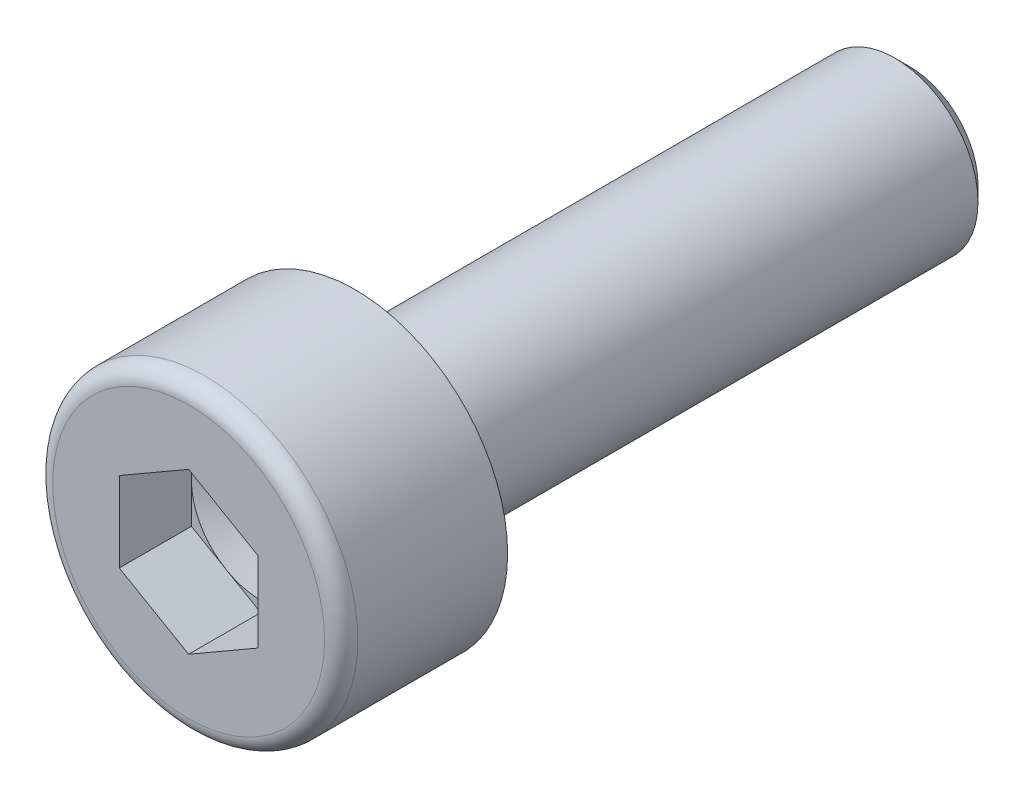
ISO-10303-21;
HEADER;
FILE_DESCRIPTION(('STEP AP214'),'2;1');
FILE_NAME('part.step','',(''),(''),'','','');
FILE_SCHEMA(('AUTOMOTIVE_DESIGN { 1 0 10303 214 1 1 1 1 }'));
ENDSEC;
DATA;
#1=APPLICATION_CONTEXT('core data for automotive mechanical design processes');
#2=APPLICATION_PROTOCOL_DEFINITION('international standard','automotive_design',2000,#1);
#3=PRODUCT_CONTEXT('',#1,'mechanical');
#4=PRODUCT('Part','Part','',(#3));
#5=PRODUCT_RELATED_PRODUCT_CATEGORY('part','',(#4));
#6=PRODUCT_DEFINITION_FORMATION('','',#4);
#7=PRODUCT_DEFINITION_CONTEXT('part definition',#1,'design');
#8=PRODUCT_DEFINITION('design','',#6,#7);
#9=PRODUCT_DEFINITION_SHAPE('','',#8);
#10=(LENGTH_UNIT() NAMED_UNIT(*) SI_UNIT(.MILLI.,.METRE.));
#11=(NAMED_UNIT(*) PLANE_ANGLE_UNIT() SI_UNIT($,.RADIAN.));
#12=(NAMED_UNIT(*) SI_UNIT($,.STERADIAN.) SOLID_ANGLE_UNIT());
#13=UNCERTAINTY_MEASURE_WITH_UNIT(LENGTH_MEASURE(1.E-05),#10,'distance_accuracy_value','');
#14=(GEOMETRIC_REPRESENTATION_CONTEXT(3) GLOBAL_UNCERTAINTY_ASSIGNED_CONTEXT((#13)) GLOBAL_UNIT_ASSIGNED_CONTEXT((#10,
#11,#12)) REPRESENTATION_CONTEXT('',''));
#15=CARTESIAN_POINT('',(0.,0.,0.));
#16=DIRECTION('',(0.,0.,1.));
#17=DIRECTION('',(1.,0.,0.));
#18=AXIS2_PLACEMENT_3D('',#15,#16,#17);
#19=CARTESIAN_POINT('',(0.,0.,-1.3));
#20=DIRECTION('',(0.,0.,1.));
#21=DIRECTION('',(1.,0.,0.));
#22=AXIS2_PLACEMENT_3D('',#19,#20,#21);
#23=PLANE('',#22);
#24=DIRECTION('',(0.,1.,0.));
#25=VECTOR('',#24,1.);
#26=CARTESIAN_POINT('',(-1.25,0.,-1.3));
#27=LINE('',#26,#25);
#28=CARTESIAN_POINT('',(-1.25,0.,-1.3));
#29=VERTEX_POINT('',#28);
#30=CARTESIAN_POINT('',(-1.25,0.721687836487032,-1.3));
#31=VERTEX_POINT('',#30);
#32=EDGE_CURVE('E289',#29,#31,#27,.T.);
#33=ORIENTED_EDGE('',*,*,#32,.F.);
#34=CARTESIAN_POINT('',(0.,0.,-1.3));
#35=DIRECTION('',(0.,0.,-1.));
#36=DIRECTION('',(-1.,0.,0.));
#37=AXIS2_PLACEMENT_3D('',#34,#35,#36);
#38=CIRCLE('',#37,1.25);
#39=CARTESIAN_POINT('',(-0.625,1.08253175473055,-1.3));
#40=VERTEX_POINT('',#39);
#41=EDGE_CURVE('E38',#29,#40,#38,.T.);
#42=ORIENTED_EDGE('',*,*,#41,.T.);
#43=DIRECTION('',(0.866025403784439,0.5,0.));
#44=VECTOR('',#43,1.);
#45=CARTESIAN_POINT('',(-0.617562637900043,1.08682571774102,-1.3));
#46=LINE('',#45,#44);
#47=EDGE_CURVE('E290',#31,#40,#46,.T.);
#48=ORIENTED_EDGE('',*,*,#47,.F.);
#49=EDGE_LOOP('',(#33,#42,#48));
#50=FACE_BOUND('',#49,.T.);
#51=ADVANCED_FACE('F17',(#50),#23,.T.);
#52=CARTESIAN_POINT('',(0.,1.44337567297406,-1.3));
#53=VERTEX_POINT('',#52);
#54=EDGE_CURVE('E294',#40,#53,#46,.T.);
#55=ORIENTED_EDGE('',*,*,#54,.F.);
#56=CARTESIAN_POINT('',(0.625,1.08253175473055,-1.3));
#57=VERTEX_POINT('',#56);
#58=EDGE_CURVE('E305',#40,#57,#38,.T.);
#59=ORIENTED_EDGE('',*,*,#58,.T.);
#60=DIRECTION('',(0.866025403784439,-0.5,0.));
#61=VECTOR('',#60,1.);
#62=CARTESIAN_POINT('',(0.625,1.08253175473055,-1.3));
#63=LINE('',#62,#61);
#64=EDGE_CURVE('E295',#53,#57,#63,.T.);
#65=ORIENTED_EDGE('',*,*,#64,.F.);
#66=EDGE_LOOP('',(#55,#59,#65));
#67=FACE_BOUND('',#66,.T.);
#68=ADVANCED_FACE('F134',(#67),#23,.T.);
#69=CARTESIAN_POINT('',(1.25,0.721687836487032,-1.3));
#70=VERTEX_POINT('',#69);
#71=EDGE_CURVE('E299',#57,#70,#63,.T.);
#72=ORIENTED_EDGE('',*,*,#71,.F.);
#73=CARTESIAN_POINT('',(1.25,0.,-1.3));
#74=VERTEX_POINT('',#73);
#75=EDGE_CURVE('E313',#57,#74,#38,.T.);
#76=ORIENTED_EDGE('',*,*,#75,.T.);
#77=DIRECTION('',(0.,-1.,0.));
#78=VECTOR('',#77,1.);
#79=CARTESIAN_POINT('',(1.25,0.,-1.3));
#80=LINE('',#79,#78);
#81=EDGE_CURVE('E300',#70,#74,#80,.T.);
#82=ORIENTED_EDGE('',*,*,#81,.F.);
#83=EDGE_LOOP('',(#72,#76,#82));
#84=FACE_BOUND('',#83,.T.);
#85=ADVANCED_FACE('F139',(#84),#23,.T.);
#86=CARTESIAN_POINT('',(1.25,-0.721687836487032,-1.3));
#87=VERTEX_POINT('',#86);
#88=EDGE_CURVE('E257',#74,#87,#80,.T.);
#89=ORIENTED_EDGE('',*,*,#88,.F.);
#90=CARTESIAN_POINT('',(0.625,-1.08253175473055,-1.3));
#91=VERTEX_POINT('',#90);
#92=EDGE_CURVE('E321',#74,#91,#38,.T.);
#93=ORIENTED_EDGE('',*,*,#92,.T.);
#94=DIRECTION('',(-0.866025403784439,-0.5,0.));
#95=VECTOR('',#94,1.);
#96=CARTESIAN_POINT('',(0.596250214161918,-1.09913045132331,-1.3));
#97=LINE('',#96,#95);
#98=EDGE_CURVE('E252',#87,#91,#97,.T.);
#99=ORIENTED_EDGE('',*,*,#98,.F.);
#100=EDGE_LOOP('',(#89,#93,#99));
#101=FACE_BOUND('',#100,.T.);
#102=ADVANCED_FACE('F338',(#101),#23,.T.);
#103=CARTESIAN_POINT('',(0.,-1.44337567297406,-1.3));
#104=VERTEX_POINT('',#103);
#105=EDGE_CURVE('E279',#91,#104,#97,.T.);
#106=ORIENTED_EDGE('',*,*,#105,.F.);
#107=CARTESIAN_POINT('',(-0.625,-1.08253175473055,-1.3));
#108=VERTEX_POINT('',#107);
#109=EDGE_CURVE('E314',#91,#108,#38,.T.);
#110=ORIENTED_EDGE('',*,*,#109,.T.);
#111=DIRECTION('',(-0.866025403784439,0.5,0.));
#112=VECTOR('',#111,1.);
#113=CARTESIAN_POINT('',(-0.625,-1.08253175473055,-1.3));
#114=LINE('',#113,#112);
#115=EDGE_CURVE('E280',#104,#108,#114,.T.);
#116=ORIENTED_EDGE('',*,*,#115,.F.);
#117=EDGE_LOOP('',(#106,#110,#116));
#118=FACE_BOUND('',#117,.T.);
#119=ADVANCED_FACE('F132',(#118),#23,.T.);
#120=CARTESIAN_POINT('',(-1.10172582585694,0.,0.));
#121=DIRECTION('',(0.,0.,-1.));
#122=DIRECTION('',(-1.,0.,0.));
#123=AXIS2_PLACEMENT_3D('',#120,#121,#122);
#124=PLANE('',#123);
#125=CARTESIAN_POINT('',(0.,0.,0.));
#126=DIRECTION('',(0.,0.,1.));
#127=DIRECTION('',(1.,0.,0.));
#128=AXIS2_PLACEMENT_3D('',#125,#126,#127);
#129=CIRCLE('',#128,2.45);
#130=CARTESIAN_POINT('',(2.45,0.,0.));
#131=VERTEX_POINT('',#130);
#132=EDGE_CURVE('E222',#131,#131,#129,.T.);
#133=ORIENTED_EDGE('',*,*,#132,.T.);
#134=EDGE_LOOP('',(#133));
#135=FACE_BOUND('',#134,.T.);
#136=DIRECTION('',(0.,-1.,0.));
#137=VECTOR('',#136,1.);
#138=CARTESIAN_POINT('',(1.25,0.,0.));
#139=LINE('',#138,#137);
#140=CARTESIAN_POINT('',(1.25,0.721687836487032,0.));
#141=VERTEX_POINT('',#140);
#142=CARTESIAN_POINT('',(1.25,-0.721687836487032,0.));
#143=VERTEX_POINT('',#142);
#144=EDGE_CURVE('E272',#141,#143,#139,.T.);
#145=ORIENTED_EDGE('',*,*,#144,.T.);
#146=DIRECTION('',(-0.866025403784439,-0.5,0.));
#147=VECTOR('',#146,1.);
#148=CARTESIAN_POINT('',(0.596250214161918,-1.09913045132331,0.));
#149=LINE('',#148,#147);
#150=CARTESIAN_POINT('',(0.,-1.44337567297406,0.));
#151=VERTEX_POINT('',#150);
#152=EDGE_CURVE('E253',#143,#151,#149,.T.);
#153=ORIENTED_EDGE('',*,*,#152,.T.);
#154=DIRECTION('',(-0.866025403784439,0.5,0.));
#155=VECTOR('',#154,1.);
#156=CARTESIAN_POINT('',(-0.625,-1.08253175473055,0.));
#157=LINE('',#156,#155);
#158=CARTESIAN_POINT('',(-1.25,-0.721687836487032,0.));
#159=VERTEX_POINT('',#158);
#160=EDGE_CURVE('E50',#151,#159,#157,.T.);
#161=ORIENTED_EDGE('',*,*,#160,.T.);
#162=DIRECTION('',(0.,1.,0.));
#163=VECTOR('',#162,1.);
#164=CARTESIAN_POINT('',(-1.25,0.,0.));
#165=LINE('',#164,#163);
#166=CARTESIAN_POINT('',(-1.25,0.721687836487032,0.));
#167=VERTEX_POINT('',#166);
#168=EDGE_CURVE('E260',#159,#167,#165,.T.);
#169=ORIENTED_EDGE('',*,*,#168,.T.);
#170=DIRECTION('',(0.866025403784439,0.5,0.));
#171=VECTOR('',#170,1.);
#172=CARTESIAN_POINT('',(-0.617562637900043,1.08682571774102,0.));
#173=LINE('',#172,#171);
#174=CARTESIAN_POINT('',(0.,1.44337567297406,0.));
#175=VERTEX_POINT('',#174);
#176=EDGE_CURVE('E264',#167,#175,#173,.T.);
#177=ORIENTED_EDGE('',*,*,#176,.T.);
#178=DIRECTION('',(0.866025403784439,-0.5,0.));
#179=VECTOR('',#178,1.);
#180=CARTESIAN_POINT('',(0.625,1.08253175473055,0.));
#181=LINE('',#180,#179);
#182=EDGE_CURVE('E268',#175,#141,#181,.T.);
#183=ORIENTED_EDGE('',*,*,#182,.T.);
#184=EDGE_LOOP('',(#145,#153,#161,#169,#177,#183));
#185=FACE_BOUND('',#184,.T.);
#186=ADVANCED_FACE('F184',(#135,#185),#124,.F.);
#187=CARTESIAN_POINT('',(0.,0.,-0.3));
#188=DIRECTION('',(0.,0.,1.));
#189=DIRECTION('',(1.,0.,0.));
#190=AXIS2_PLACEMENT_3D('',#187,#188,#189);
#191=TOROIDAL_SURFACE('',#190,2.45,0.3);
#192=CARTESIAN_POINT('',(0.,0.,-0.3));
#193=DIRECTION('',(0.,0.,1.));
#194=DIRECTION('',(1.,0.,0.));
#195=AXIS2_PLACEMENT_3D('',#192,#193,#194);
#196=CIRCLE('',#195,2.75);
#197=CARTESIAN_POINT('',(2.75,0.,-0.3));
#198=VERTEX_POINT('',#197);
#199=EDGE_CURVE('E226',#198,#198,#196,.T.);
#200=ORIENTED_EDGE('',*,*,#199,.T.);
#201=EDGE_LOOP('',(#200));
#202=FACE_BOUND('',#201,.T.);
#203=ORIENTED_EDGE('',*,*,#132,.F.);
#204=EDGE_LOOP('',(#203));
#205=FACE_BOUND('',#204,.T.);
#206=ADVANCED_FACE('F180',(#202,#205),#191,.T.);
#207=CARTESIAN_POINT('',(0.,0.,-6.5));
#208=DIRECTION('',(0.,0.,1.));
#209=DIRECTION('',(1.,0.,0.));
#210=AXIS2_PLACEMENT_3D('',#207,#208,#209);
#211=CYLINDRICAL_SURFACE('',#210,2.75);
#212=ORIENTED_EDGE('',*,*,#199,.F.);
#213=EDGE_LOOP('',(#212));
#214=FACE_BOUND('',#213,.T.);
#215=CARTESIAN_POINT('',(0.,0.,-3.));
#216=DIRECTION('',(0.,0.,1.));
#217=DIRECTION('',(1.,0.,0.));
#218=AXIS2_PLACEMENT_3D('',#215,#216,#217);
#219=CIRCLE('',#218,2.75);
#220=CARTESIAN_POINT('',(2.75,0.,-3.));
#221=VERTEX_POINT('',#220);
#222=EDGE_CURVE('E230',#221,#221,#219,.T.);
#223=ORIENTED_EDGE('',*,*,#222,.T.);
#224=EDGE_LOOP('',(#223));
#225=FACE_BOUND('',#224,.T.);
#226=ADVANCED_FACE('F176',(#214,#225),#211,.T.);
#227=CARTESIAN_POINT('',(-1.61056634651914,0.,-3.));
#228=DIRECTION('',(0.,0.,1.));
#229=DIRECTION('',(1.,0.,0.));
#230=AXIS2_PLACEMENT_3D('',#227,#228,#229);
#231=PLANE('',#230);
#232=CARTESIAN_POINT('',(0.,0.,-3.));
#233=DIRECTION('',(0.,0.,1.));
#234=DIRECTION('',(1.,0.,0.));
#235=AXIS2_PLACEMENT_3D('',#232,#233,#234);
#236=CIRCLE('',#235,1.85719460543127);
#237=CARTESIAN_POINT('',(1.85719460543127,0.,-3.));
#238=VERTEX_POINT('',#237);
#239=EDGE_CURVE('E204',#238,#238,#236,.T.);
#240=ORIENTED_EDGE('',*,*,#239,.T.);
#241=EDGE_LOOP('',(#240));
#242=FACE_BOUND('',#241,.T.);
#243=ORIENTED_EDGE('',*,*,#222,.F.);
#244=EDGE_LOOP('',(#243));
#245=FACE_BOUND('',#244,.T.);
#246=ADVANCED_FACE('F172',(#242,#245),#231,.F.);
#247=CARTESIAN_POINT('',(0.,0.,-6.5));
#248=DIRECTION('',(0.,0.,1.));
#249=DIRECTION('',(1.,0.,0.));
#250=AXIS2_PLACEMENT_3D('',#247,#248,#249);
#251=CYLINDRICAL_SURFACE('',#250,1.5);
#252=CARTESIAN_POINT('',(0.,0.,-12.7293670625));
#253=DIRECTION('',(0.,0.,1.));
#254=DIRECTION('',(1.,0.,0.));
#255=AXIS2_PLACEMENT_3D('',#252,#253,#254);
#256=CIRCLE('',#255,1.5);
#257=CARTESIAN_POINT('',(1.5,0.,-12.7293670625));
#258=VERTEX_POINT('',#257);
#259=EDGE_CURVE('E26',#258,#258,#256,.T.);
#260=ORIENTED_EDGE('',*,*,#259,.T.);
#261=EDGE_LOOP('',(#260));
#262=FACE_BOUND('',#261,.T.);
#263=CARTESIAN_POINT('',(0.,0.,-3.53723082923316));
#264=DIRECTION('',(0.,0.,-1.));
#265=DIRECTION('',(-1.,0.,0.));
#266=AXIS2_PLACEMENT_3D('',#263,#264,#265);
#267=CIRCLE('',#266,1.5);
#268=CARTESIAN_POINT('',(-1.5,0.,-3.53723082923316));
#269=VERTEX_POINT('',#268);
#270=EDGE_CURVE('E218',#269,#269,#267,.T.);
#271=ORIENTED_EDGE('',*,*,#270,.T.);
#272=EDGE_LOOP('',(#271));
#273=FACE_BOUND('',#272,.T.);
#274=ADVANCED_FACE('F168',(#262,#273),#251,.T.);
#275=CARTESIAN_POINT('',(-0.508840520662193,0.,-13.));
#276=DIRECTION('',(0.,0.,1.));
#277=DIRECTION('',(1.,0.,0.));
#278=AXIS2_PLACEMENT_3D('',#275,#276,#277);
#279=PLANE('',#278);
#280=CARTESIAN_POINT('',(0.,0.,-13.));
#281=DIRECTION('',(0.,0.,1.));
#282=DIRECTION('',(1.,0.,0.));
#283=AXIS2_PLACEMENT_3D('',#280,#281,#282);
#284=CIRCLE('',#283,1.2293670625);
#285=CARTESIAN_POINT('',(1.2293670625,0.,-13.));
#286=VERTEX_POINT('',#285);
#287=EDGE_CURVE('E11',#286,#286,#284,.F.);
#288=ORIENTED_EDGE('',*,*,#287,.T.);
#289=EDGE_LOOP('',(#288));
#290=FACE_BOUND('',#289,.T.);
#291=ADVANCED_FACE('F164',(#290),#279,.F.);
#292=CARTESIAN_POINT('',(1.25,0.,-1.3));
#293=DIRECTION('',(-1.,0.,0.));
#294=DIRECTION('',(0.,-1.,0.));
#295=AXIS2_PLACEMENT_3D('',#292,#293,#294);
#296=PLANE('',#295);
#297=ORIENTED_EDGE('',*,*,#144,.F.);
#298=DIRECTION('',(0.,0.,1.));
#299=VECTOR('',#298,1.);
#300=CARTESIAN_POINT('',(1.25,0.721687836487032,-1.3));
#301=LINE('',#300,#299);
#302=EDGE_CURVE('E234',#70,#141,#301,.T.);
#303=ORIENTED_EDGE('',*,*,#302,.F.);
#304=ORIENTED_EDGE('',*,*,#81,.T.);
#305=ORIENTED_EDGE('',*,*,#88,.T.);
#306=DIRECTION('',(0.,0.,1.));
#307=VECTOR('',#306,1.);
#308=CARTESIAN_POINT('',(1.25,-0.721687836487032,-1.3));
#309=LINE('',#308,#307);
#310=EDGE_CURVE('E249',#87,#143,#309,.T.);
#311=ORIENTED_EDGE('',*,*,#310,.T.);
#312=EDGE_LOOP('',(#297,#303,#304,#305,#311));
#313=FACE_BOUND('',#312,.T.);
#314=ADVANCED_FACE('F160',(#313),#296,.T.);
#315=CARTESIAN_POINT('',(0.625,1.08253175473055,-1.3));
#316=DIRECTION('',(-0.5,-0.866025403784439,0.));
#317=DIRECTION('',(0.866025403784439,-0.5,0.));
#318=AXIS2_PLACEMENT_3D('',#315,#316,#317);
#319=PLANE('',#318);
#320=ORIENTED_EDGE('',*,*,#182,.F.);
#321=DIRECTION('',(0.,0.,1.));
#322=VECTOR('',#321,1.);
#323=CARTESIAN_POINT('',(0.,1.44337567297406,-1.3));
#324=LINE('',#323,#322);
#325=EDGE_CURVE('E237',#53,#175,#324,.T.);
#326=ORIENTED_EDGE('',*,*,#325,.F.);
#327=ORIENTED_EDGE('',*,*,#64,.T.);
#328=ORIENTED_EDGE('',*,*,#71,.T.);
#329=ORIENTED_EDGE('',*,*,#302,.T.);
#330=EDGE_LOOP('',(#320,#326,#327,#328,#329));
#331=FACE_BOUND('',#330,.T.);
#332=ADVANCED_FACE('F156',(#331),#319,.T.);
#333=CARTESIAN_POINT('',(-0.617562637900043,1.08682571774102,-1.3));
#334=DIRECTION('',(0.5,-0.866025403784439,0.));
#335=DIRECTION('',(0.866025403784439,0.5,0.));
#336=AXIS2_PLACEMENT_3D('',#333,#334,#335);
#337=PLANE('',#336);
#338=ORIENTED_EDGE('',*,*,#176,.F.);
#339=DIRECTION('',(0.,0.,1.));
#340=VECTOR('',#339,1.);
#341=CARTESIAN_POINT('',(-1.25,0.721687836487032,-1.3));
#342=LINE('',#341,#340);
#343=EDGE_CURVE('E240',#31,#167,#342,.T.);
#344=ORIENTED_EDGE('',*,*,#343,.F.);
#345=ORIENTED_EDGE('',*,*,#47,.T.);
#346=ORIENTED_EDGE('',*,*,#54,.T.);
#347=ORIENTED_EDGE('',*,*,#325,.T.);
#348=EDGE_LOOP('',(#338,#344,#345,#346,#347));
#349=FACE_BOUND('',#348,.T.);
#350=ADVANCED_FACE('F152',(#349),#337,.T.);
#351=CARTESIAN_POINT('',(-1.25,0.,-1.3));
#352=DIRECTION('',(1.,0.,0.));
#353=DIRECTION('',(0.,1.,0.));
#354=AXIS2_PLACEMENT_3D('',#351,#352,#353);
#355=PLANE('',#354);
#356=ORIENTED_EDGE('',*,*,#168,.F.);
#357=DIRECTION('',(0.,0.,1.));
#358=VECTOR('',#357,1.);
#359=CARTESIAN_POINT('',(-1.25,-0.721687836487032,-1.3));
#360=LINE('',#359,#358);
#361=CARTESIAN_POINT('',(-1.25,-0.721687836487032,-1.3));
#362=VERTEX_POINT('',#361);
#363=EDGE_CURVE('E243',#362,#159,#360,.T.);
#364=ORIENTED_EDGE('',*,*,#363,.F.);
#365=EDGE_CURVE('E285',#362,#29,#27,.T.);
#366=ORIENTED_EDGE('',*,*,#365,.T.);
#367=ORIENTED_EDGE('',*,*,#32,.T.);
#368=ORIENTED_EDGE('',*,*,#343,.T.);
#369=EDGE_LOOP('',(#356,#364,#366,#367,#368));
#370=FACE_BOUND('',#369,.T.);
#371=ADVANCED_FACE('F149',(#370),#355,.T.);
#372=CARTESIAN_POINT('',(-0.625,-1.08253175473055,-1.3));
#373=DIRECTION('',(0.5,0.866025403784439,0.));
#374=DIRECTION('',(-0.866025403784439,0.5,0.));
#375=AXIS2_PLACEMENT_3D('',#372,#373,#374);
#376=PLANE('',#375);
#377=ORIENTED_EDGE('',*,*,#160,.F.);
#378=DIRECTION('',(0.,0.,1.));
#379=VECTOR('',#378,1.);
#380=CARTESIAN_POINT('',(0.,-1.44337567297406,-1.3));
#381=LINE('',#380,#379);
#382=EDGE_CURVE('E246',#104,#151,#381,.T.);
#383=ORIENTED_EDGE('',*,*,#382,.F.);
#384=ORIENTED_EDGE('',*,*,#115,.T.);
#385=EDGE_CURVE('E284',#108,#362,#114,.T.);
#386=ORIENTED_EDGE('',*,*,#385,.T.);
#387=ORIENTED_EDGE('',*,*,#363,.T.);
#388=EDGE_LOOP('',(#377,#383,#384,#386,#387));
#389=FACE_BOUND('',#388,.T.);
#390=ADVANCED_FACE('F145',(#389),#376,.T.);
#391=CARTESIAN_POINT('',(0.596250214161918,-1.09913045132331,-1.3));
#392=DIRECTION('',(-0.5,0.866025403784439,0.));
#393=DIRECTION('',(-0.866025403784439,-0.5,0.));
#394=AXIS2_PLACEMENT_3D('',#391,#392,#393);
#395=PLANE('',#394);
#396=ORIENTED_EDGE('',*,*,#152,.F.);
#397=ORIENTED_EDGE('',*,*,#310,.F.);
#398=ORIENTED_EDGE('',*,*,#98,.T.);
#399=ORIENTED_EDGE('',*,*,#105,.T.);
#400=ORIENTED_EDGE('',*,*,#382,.T.);
#401=EDGE_LOOP('',(#396,#397,#398,#399,#400));
#402=FACE_BOUND('',#401,.T.);
#403=ADVANCED_FACE('F129',(#402),#395,.T.);
#404=ORIENTED_EDGE('',*,*,#385,.F.);
#405=EDGE_CURVE('E306',#108,#29,#38,.T.);
#406=ORIENTED_EDGE('',*,*,#405,.T.);
#407=ORIENTED_EDGE('',*,*,#365,.F.);
#408=EDGE_LOOP('',(#404,#406,#407));
#409=FACE_BOUND('',#408,.T.);
#410=ADVANCED_FACE('F119',(#409),#23,.T.);
#411=CARTESIAN_POINT('',(0.,0.,-1.3));
#412=DIRECTION('',(0.,0.,1.));
#413=DIRECTION('',(1.,0.,0.));
#414=AXIS2_PLACEMENT_3D('',#411,#412,#413);
#415=CONICAL_SURFACE('',#414,1.25,1.22173047639603);
#416=CARTESIAN_POINT('',(0.,0.,-1.75496279283276));
#417=VERTEX_POINT('',#416);
#418=VERTEX_LOOP('',#417);
#419=FACE_BOUND('',#418,.T.);
#420=ORIENTED_EDGE('',*,*,#41,.F.);
#421=ORIENTED_EDGE('',*,*,#405,.F.);
#422=ORIENTED_EDGE('',*,*,#109,.F.);
#423=ORIENTED_EDGE('',*,*,#92,.F.);
#424=ORIENTED_EDGE('',*,*,#75,.F.);
#425=ORIENTED_EDGE('',*,*,#58,.F.);
#426=EDGE_LOOP('',(#420,#421,#422,#423,#424,#425));
#427=FACE_BOUND('',#426,.T.);
#428=ADVANCED_FACE('F116',(#419,#427),#415,.F.);
#429=CARTESIAN_POINT('',(0.,0.,-3.));
#430=DIRECTION('',(0.,0.,1.));
#431=DIRECTION('',(1.,0.,0.));
#432=AXIS2_PLACEMENT_3D('',#429,#430,#431);
#433=CONICAL_SURFACE('',#432,1.8,0.531724067258806);
#434=CARTESIAN_POINT('',(0.,0.,-3.48652881657682));
#435=DIRECTION('',(0.,0.,1.));
#436=DIRECTION('',(1.,0.,0.));
#437=AXIS2_PLACEMENT_3D('',#434,#435,#436);
#438=CIRCLE('',#437,1.51380657848422);
#439=CARTESIAN_POINT('',(1.51380657848422,0.,-3.48652881657682));
#440=VERTEX_POINT('',#439);
#441=EDGE_CURVE('E206',#440,#440,#438,.T.);
#442=ORIENTED_EDGE('',*,*,#441,.T.);
#443=EDGE_LOOP('',(#442));
#444=FACE_BOUND('',#443,.T.);
#445=CARTESIAN_POINT('',(0.,0.,-3.04929798734366));
#446=DIRECTION('',(0.,0.,1.));
#447=DIRECTION('',(1.,0.,0.));
#448=AXIS2_PLACEMENT_3D('',#445,#446,#447);
#449=CIRCLE('',#448,1.77100118391549);
#450=CARTESIAN_POINT('',(1.77100118391549,0.,-3.04929798734366));
#451=VERTEX_POINT('',#450);
#452=EDGE_CURVE('E201',#451,#451,#449,.F.);
#453=ORIENTED_EDGE('',*,*,#452,.T.);
#454=EDGE_LOOP('',(#453));
#455=FACE_BOUND('',#454,.T.);
#456=ADVANCED_FACE('F118',(#444,#455),#433,.T.);
#457=CARTESIAN_POINT('',(0.,0.,-3.53723082923316));
#458=DIRECTION('',(0.,0.,-1.));
#459=DIRECTION('',(-1.,0.,0.));
#460=AXIS2_PLACEMENT_3D('',#457,#458,#459);
#461=TOROIDAL_SURFACE('',#460,1.6,0.1);
#462=ORIENTED_EDGE('',*,*,#441,.F.);
#463=EDGE_LOOP('',(#462));
#464=FACE_BOUND('',#463,.T.);
#465=ORIENTED_EDGE('',*,*,#270,.F.);
#466=EDGE_LOOP('',(#465));
#467=FACE_BOUND('',#466,.T.);
#468=ADVANCED_FACE('F126',(#464,#467),#461,.F.);
#469=CARTESIAN_POINT('',(0.,0.,-3.1));
#470=DIRECTION('',(0.,0.,1.));
#471=DIRECTION('',(1.,0.,0.));
#472=AXIS2_PLACEMENT_3D('',#469,#470,#471);
#473=TOROIDAL_SURFACE('',#472,1.85719460543127,0.1);
#474=ORIENTED_EDGE('',*,*,#452,.F.);
#475=EDGE_LOOP('',(#474));
#476=FACE_BOUND('',#475,.T.);
#477=ORIENTED_EDGE('',*,*,#239,.F.);
#478=EDGE_LOOP('',(#477));
#479=FACE_BOUND('',#478,.T.);
#480=ADVANCED_FACE('F190',(#476,#479),#473,.F.);
#481=CARTESIAN_POINT('',(0.,0.,-12.7293670625));
#482=DIRECTION('',(0.,0.,1.));
#483=DIRECTION('',(1.,0.,0.));
#484=AXIS2_PLACEMENT_3D('',#481,#482,#483);
#485=CONICAL_SURFACE('',#484,1.5,0.78539816339745);
#486=ORIENTED_EDGE('',*,*,#287,.F.);
#487=EDGE_LOOP('',(#486));
#488=FACE_BOUND('',#487,.T.);
#489=ORIENTED_EDGE('',*,*,#259,.F.);
#490=EDGE_LOOP('',(#489));
#491=FACE_BOUND('',#490,.T.);
#492=ADVANCED_FACE('F19',(#488,#491),#485,.T.);
#493=CLOSED_SHELL('',(#51,#68,#85,#102,#119,#186,#206,#226,#246,#274,#291,#314,#332,#350,#371,
#390,#403,#410,#428,#456,#468,#480,#492));
#494=MANIFOLD_SOLID_BREP('B1',#493);
#495=ADVANCED_BREP_SHAPE_REPRESENTATION('',(#18,#494),#14);
#496=SHAPE_DEFINITION_REPRESENTATION(#9,#495);
ENDSEC;
END-ISO-10303-21;
